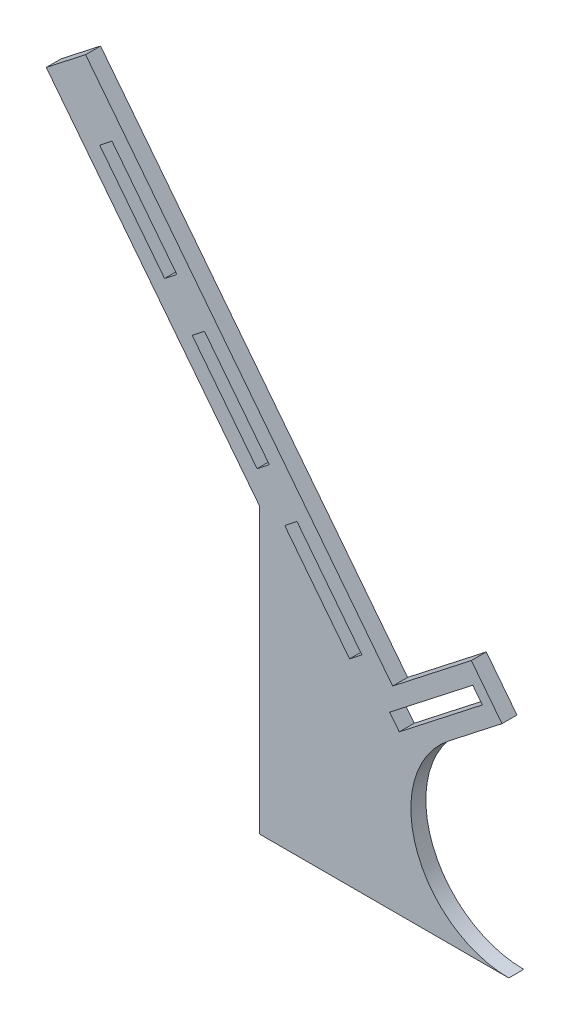
ISO-10303-21;
HEADER;
FILE_DESCRIPTION(('STEP AP214'),'2;1');
FILE_NAME('part.step','',(''),(''),'','','');
FILE_SCHEMA(('AUTOMOTIVE_DESIGN { 1 0 10303 214 1 1 1 1 }'));
ENDSEC;
DATA;
#1=APPLICATION_CONTEXT('core data for automotive mechanical design processes');
#2=APPLICATION_PROTOCOL_DEFINITION('international standard','automotive_design',2000,#1);
#3=PRODUCT_CONTEXT('',#1,'mechanical');
#4=PRODUCT('Part','Part','',(#3));
#5=PRODUCT_RELATED_PRODUCT_CATEGORY('part','',(#4));
#6=PRODUCT_DEFINITION_FORMATION('','',#4);
#7=PRODUCT_DEFINITION_CONTEXT('part definition',#1,'design');
#8=PRODUCT_DEFINITION('design','',#6,#7);
#9=PRODUCT_DEFINITION_SHAPE('','',#8);
#10=(LENGTH_UNIT() NAMED_UNIT(*) SI_UNIT(.MILLI.,.METRE.));
#11=(NAMED_UNIT(*) PLANE_ANGLE_UNIT() SI_UNIT($,.RADIAN.));
#12=(NAMED_UNIT(*) SI_UNIT($,.STERADIAN.) SOLID_ANGLE_UNIT());
#13=UNCERTAINTY_MEASURE_WITH_UNIT(LENGTH_MEASURE(1.E-05),#10,'distance_accuracy_value','');
#14=(GEOMETRIC_REPRESENTATION_CONTEXT(3) GLOBAL_UNCERTAINTY_ASSIGNED_CONTEXT((#13)) GLOBAL_UNIT_ASSIGNED_CONTEXT((#10,
#11,#12)) REPRESENTATION_CONTEXT('',''));
#15=CARTESIAN_POINT('',(0.,0.,0.));
#16=DIRECTION('',(0.,0.,1.));
#17=DIRECTION('',(1.,0.,0.));
#18=AXIS2_PLACEMENT_3D('',#15,#16,#17);
#19=CARTESIAN_POINT('',(1.72726328877394,39.0362588153415,3.));
#20=DIRECTION('',(-0.61544977632838,0.788176105205776,0.));
#21=DIRECTION('',(-0.788176105205776,-0.61544977632838,0.));
#22=AXIS2_PLACEMENT_3D('',#19,#20,#21);
#23=PLANE('',#22);
#24=DIRECTION('',(0.788176105205776,0.61544977632838,0.));
#25=VECTOR('',#24,1.);
#26=CARTESIAN_POINT('',(1.72726328877394,39.0362588153415,0.));
#27=LINE('',#26,#25);
#28=CARTESIAN_POINT('',(1.72726328877394,39.0362588153415,0.));
#29=VERTEX_POINT('',#28);
#30=CARTESIAN_POINT('',(17.4907853928895,51.3452543419092,0.));
#31=VERTEX_POINT('',#30);
#32=EDGE_CURVE('E326',#29,#31,#27,.T.);
#33=ORIENTED_EDGE('',*,*,#32,.F.);
#34=DIRECTION('',(0.,0.,-1.));
#35=VECTOR('',#34,1.);
#36=CARTESIAN_POINT('',(1.72726328877394,39.0362588153415,3.));
#37=LINE('',#36,#35);
#38=CARTESIAN_POINT('',(1.72726328877394,39.0362588153415,3.));
#39=VERTEX_POINT('',#38);
#40=EDGE_CURVE('E11',#39,#29,#37,.T.);
#41=ORIENTED_EDGE('',*,*,#40,.F.);
#42=DIRECTION('',(0.788176105205776,0.61544977632838,0.));
#43=VECTOR('',#42,1.);
#44=CARTESIAN_POINT('',(1.72726328877394,39.0362588153415,3.));
#45=LINE('',#44,#43);
#46=CARTESIAN_POINT('',(17.4907853928895,51.3452543419092,3.));
#47=VERTEX_POINT('',#46);
#48=EDGE_CURVE('E362',#39,#47,#45,.T.);
#49=ORIENTED_EDGE('',*,*,#48,.T.);
#50=DIRECTION('',(0.,0.,-1.));
#51=VECTOR('',#50,1.);
#52=CARTESIAN_POINT('',(17.4907853928895,51.3452543419092,3.));
#53=LINE('',#52,#51);
#54=EDGE_CURVE('E44',#47,#31,#53,.T.);
#55=ORIENTED_EDGE('',*,*,#54,.T.);
#56=EDGE_LOOP('',(#33,#41,#49,#55));
#57=FACE_BOUND('',#56,.T.);
#58=ADVANCED_FACE('F41',(#57),#23,.T.);
#59=CARTESIAN_POINT('',(1.72726328877394,39.0362588153415,3.));
#60=DIRECTION('',(-0.788176105205774,-0.615449776328383,0.));
#61=DIRECTION('',(0.615449776328383,-0.788176105205774,0.));
#62=AXIS2_PLACEMENT_3D('',#59,#60,#61);
#63=PLANE('',#62);
#64=DIRECTION('',(-0.615449776328382,0.788176105205774,0.));
#65=VECTOR('',#64,1.);
#66=CARTESIAN_POINT('',(1.72726328877394,39.0362588153415,0.));
#67=LINE('',#66,#65);
#68=CARTESIAN_POINT('',(-59.8177143440644,117.853869335919,0.));
#69=VERTEX_POINT('',#68);
#70=EDGE_CURVE('E366',#29,#69,#67,.T.);
#71=ORIENTED_EDGE('',*,*,#70,.T.);
#72=DIRECTION('',(0.,0.,-1.));
#73=VECTOR('',#72,1.);
#74=CARTESIAN_POINT('',(-59.8177143440644,117.853869335919,3.));
#75=LINE('',#74,#73);
#76=CARTESIAN_POINT('',(-59.8177143440644,117.853869335919,3.));
#77=VERTEX_POINT('',#76);
#78=EDGE_CURVE('E49',#77,#69,#75,.T.);
#79=ORIENTED_EDGE('',*,*,#78,.F.);
#80=DIRECTION('',(-0.615449776328382,0.788176105205774,0.));
#81=VECTOR('',#80,1.);
#82=CARTESIAN_POINT('',(1.72726328877394,39.0362588153415,3.));
#83=LINE('',#82,#81);
#84=EDGE_CURVE('E376',#39,#77,#83,.T.);
#85=ORIENTED_EDGE('',*,*,#84,.F.);
#86=ORIENTED_EDGE('',*,*,#40,.T.);
#87=EDGE_LOOP('',(#71,#79,#85,#86));
#88=FACE_BOUND('',#87,.T.);
#89=ADVANCED_FACE('F412',(#88),#63,.F.);
#90=CARTESIAN_POINT('',(-67.6994753961221,111.699371572635,3.));
#91=DIRECTION('',(-0.615449776328385,0.788176105205772,0.));
#92=DIRECTION('',(-0.788176105205772,-0.615449776328386,0.));
#93=AXIS2_PLACEMENT_3D('',#90,#91,#92);
#94=PLANE('',#93);
#95=DIRECTION('',(0.788176105205772,0.615449776328386,0.));
#96=VECTOR('',#95,1.);
#97=CARTESIAN_POINT('',(-67.6994753961221,111.699371572635,0.));
#98=LINE('',#97,#96);
#99=CARTESIAN_POINT('',(-67.6994753961221,111.699371572635,0.));
#100=VERTEX_POINT('',#99);
#101=EDGE_CURVE('E387',#100,#69,#98,.T.);
#102=ORIENTED_EDGE('',*,*,#101,.F.);
#103=DIRECTION('',(0.,0.,-1.));
#104=VECTOR('',#103,1.);
#105=CARTESIAN_POINT('',(-67.6994753961221,111.699371572635,3.));
#106=LINE('',#105,#104);
#107=CARTESIAN_POINT('',(-67.6994753961221,111.699371572635,3.));
#108=VERTEX_POINT('',#107);
#109=EDGE_CURVE('E393',#108,#100,#106,.T.);
#110=ORIENTED_EDGE('',*,*,#109,.F.);
#111=DIRECTION('',(0.788176105205772,0.615449776328386,0.));
#112=VECTOR('',#111,1.);
#113=CARTESIAN_POINT('',(-67.6994753961221,111.699371572635,3.));
#114=LINE('',#113,#112);
#115=EDGE_CURVE('E373',#108,#77,#114,.T.);
#116=ORIENTED_EDGE('',*,*,#115,.T.);
#117=ORIENTED_EDGE('',*,*,#78,.T.);
#118=EDGE_LOOP('',(#102,#110,#116,#117));
#119=FACE_BOUND('',#118,.T.);
#120=ADVANCED_FACE('F432',(#119),#94,.T.);
#121=CARTESIAN_POINT('',(0.,25.,3.));
#122=DIRECTION('',(-0.788176105205774,-0.615449776328383,0.));
#123=DIRECTION('',(0.615449776328383,-0.788176105205774,0.));
#124=AXIS2_PLACEMENT_3D('',#121,#122,#123);
#125=PLANE('',#124);
#126=DIRECTION('',(0.,0.,-1.));
#127=VECTOR('',#126,1.);
#128=CARTESIAN_POINT('',(-25.,57.0162641827508,3.));
#129=LINE('',#128,#127);
#130=CARTESIAN_POINT('',(-25.,57.0162641827508,3.));
#131=VERTEX_POINT('',#130);
#132=CARTESIAN_POINT('',(-25.,57.0162641827507,0.));
#133=VERTEX_POINT('',#132);
#134=EDGE_CURVE('E235',#131,#133,#129,.T.);
#135=ORIENTED_EDGE('',*,*,#134,.F.);
#136=DIRECTION('',(-0.615449776328383,0.788176105205774,0.));
#137=VECTOR('',#136,1.);
#138=CARTESIAN_POINT('',(0.,25.,3.));
#139=LINE('',#138,#137);
#140=EDGE_CURVE('E371',#131,#108,#139,.T.);
#141=ORIENTED_EDGE('',*,*,#140,.T.);
#142=ORIENTED_EDGE('',*,*,#109,.T.);
#143=DIRECTION('',(-0.615449776328383,0.788176105205774,0.));
#144=VECTOR('',#143,1.);
#145=CARTESIAN_POINT('',(0.,25.,0.));
#146=LINE('',#145,#144);
#147=EDGE_CURVE('E385',#133,#100,#146,.T.);
#148=ORIENTED_EDGE('',*,*,#147,.F.);
#149=EDGE_LOOP('',(#135,#141,#142,#148));
#150=FACE_BOUND('',#149,.T.);
#151=ADVANCED_FACE('F429',(#150),#125,.T.);
#152=CARTESIAN_POINT('',(0.,25.,3.));
#153=DIRECTION('',(-0.61544977632838,0.788176105205776,0.));
#154=DIRECTION('',(-0.788176105205777,-0.61544977632838,0.));
#155=AXIS2_PLACEMENT_3D('',#152,#153,#154);
#156=PLANE('',#155);
#157=DIRECTION('',(0.788176105205776,0.61544977632838,0.));
#158=VECTOR('',#157,1.);
#159=CARTESIAN_POINT('',(0.,25.,3.));
#160=LINE('',#159,#158);
#161=CARTESIAN_POINT('',(12.9225928541933,35.0906470383539,3.));
#162=VERTEX_POINT('',#161);
#163=CARTESIAN_POINT('',(23.6452831561733,43.4634932898514,3.));
#164=VERTEX_POINT('',#163);
#165=EDGE_CURVE('E369',#162,#164,#160,.T.);
#166=ORIENTED_EDGE('',*,*,#165,.F.);
#167=DIRECTION('',(0.,0.,-1.));
#168=VECTOR('',#167,1.);
#169=CARTESIAN_POINT('',(12.9225928541933,35.0906470383539,3.));
#170=LINE('',#169,#168);
#171=CARTESIAN_POINT('',(12.9225928541933,35.0906470383539,0.));
#172=VERTEX_POINT('',#171);
#173=EDGE_CURVE('E216',#162,#172,#170,.T.);
#174=ORIENTED_EDGE('',*,*,#173,.T.);
#175=DIRECTION('',(0.788176105205776,0.61544977632838,0.));
#176=VECTOR('',#175,1.);
#177=CARTESIAN_POINT('',(0.,25.,0.));
#178=LINE('',#177,#176);
#179=CARTESIAN_POINT('',(23.6452831561733,43.4634932898514,0.));
#180=VERTEX_POINT('',#179);
#181=EDGE_CURVE('E383',#172,#180,#178,.T.);
#182=ORIENTED_EDGE('',*,*,#181,.T.);
#183=DIRECTION('',(0.,0.,-1.));
#184=VECTOR('',#183,1.);
#185=CARTESIAN_POINT('',(23.6452831561733,43.4634932898514,3.));
#186=LINE('',#185,#184);
#187=EDGE_CURVE('E395',#164,#180,#186,.T.);
#188=ORIENTED_EDGE('',*,*,#187,.F.);
#189=EDGE_LOOP('',(#166,#174,#182,#188));
#190=FACE_BOUND('',#189,.T.);
#191=ADVANCED_FACE('F416',(#190),#156,.F.);
#192=CARTESIAN_POINT('',(17.4907853928895,51.3452543419092,3.));
#193=DIRECTION('',(0.788176105205776,0.61544977632838,0.));
#194=DIRECTION('',(-0.61544977632838,0.788176105205776,0.));
#195=AXIS2_PLACEMENT_3D('',#192,#193,#194);
#196=PLANE('',#195);
#197=DIRECTION('',(0.61544977632838,-0.788176105205776,0.));
#198=VECTOR('',#197,1.);
#199=CARTESIAN_POINT('',(17.4907853928895,51.3452543419092,0.));
#200=LINE('',#199,#198);
#201=EDGE_CURVE('E380',#31,#180,#200,.T.);
#202=ORIENTED_EDGE('',*,*,#201,.F.);
#203=ORIENTED_EDGE('',*,*,#54,.F.);
#204=DIRECTION('',(0.61544977632838,-0.788176105205776,0.));
#205=VECTOR('',#204,1.);
#206=CARTESIAN_POINT('',(17.4907853928895,51.3452543419092,3.));
#207=LINE('',#206,#205);
#208=EDGE_CURVE('E365',#47,#164,#207,.T.);
#209=ORIENTED_EDGE('',*,*,#208,.T.);
#210=ORIENTED_EDGE('',*,*,#187,.T.);
#211=EDGE_LOOP('',(#202,#203,#209,#210));
#212=FACE_BOUND('',#211,.T.);
#213=ADVANCED_FACE('F404',(#212),#196,.T.);
#214=CARTESIAN_POINT('',(0.,0.,3.));
#215=DIRECTION('',(0.,0.,-1.));
#216=DIRECTION('',(-1.,0.,0.));
#217=AXIS2_PLACEMENT_3D('',#214,#215,#216);
#218=PLANE('',#217);
#219=CARTESIAN_POINT('',(25.,19.6237087254422,3.));
#220=DIRECTION('',(0.,0.,1.));
#221=DIRECTION('',(1.,0.,0.));
#222=AXIS2_PLACEMENT_3D('',#219,#220,#221);
#223=CIRCLE('',#222,19.6237087254422);
#224=CARTESIAN_POINT('',(25.,0.,3.));
#225=VERTEX_POINT('',#224);
#226=EDGE_CURVE('E209',#225,#162,#223,.F.);
#227=ORIENTED_EDGE('',*,*,#226,.T.);
#228=ORIENTED_EDGE('',*,*,#165,.T.);
#229=ORIENTED_EDGE('',*,*,#208,.F.);
#230=ORIENTED_EDGE('',*,*,#48,.F.);
#231=ORIENTED_EDGE('',*,*,#84,.T.);
#232=ORIENTED_EDGE('',*,*,#115,.F.);
#233=ORIENTED_EDGE('',*,*,#140,.F.);
#234=DIRECTION('',(0.,1.,0.));
#235=VECTOR('',#234,1.);
#236=CARTESIAN_POINT('',(-25.,0.,3.));
#237=LINE('',#236,#235);
#238=CARTESIAN_POINT('',(-25.,0.,3.));
#239=VERTEX_POINT('',#238);
#240=EDGE_CURVE('E219',#239,#131,#237,.T.);
#241=ORIENTED_EDGE('',*,*,#240,.F.);
#242=DIRECTION('',(1.,0.,0.));
#243=VECTOR('',#242,1.);
#244=CARTESIAN_POINT('',(0.,0.,3.));
#245=LINE('',#244,#243);
#246=EDGE_CURVE('E220',#239,#225,#245,.T.);
#247=ORIENTED_EDGE('',*,*,#246,.T.);
#248=EDGE_LOOP('',(#227,#228,#229,#230,#231,#232,#233,#241,#247));
#249=FACE_BOUND('',#248,.T.);
#250=DIRECTION('',(-0.788176105205774,-0.615449776328383,0.));
#251=VECTOR('',#250,1.);
#252=CARTESIAN_POINT('',(-53.2865048829201,68.2413927082801,3.));
#253=LINE('',#252,#251);
#254=CARTESIAN_POINT('',(-35.9878171772055,81.7491270952253,3.));
#255=VERTEX_POINT('',#254);
#256=CARTESIAN_POINT('',(-38.4492911537631,79.8270774437517,3.));
#257=VERTEX_POINT('',#256);
#258=EDGE_CURVE('E254',#255,#257,#253,.T.);
#259=ORIENTED_EDGE('',*,*,#258,.F.);
#260=DIRECTION('',(-0.615449776328384,0.788176105205774,0.));
#261=VECTOR('',#260,1.);
#262=CARTESIAN_POINT('',(35.8378813180544,-10.2344944301683,3.));
#263=LINE('',#262,#261);
#264=CARTESIAN_POINT('',(-22.9876715518211,65.1004832249638,3.));
#265=VERTEX_POINT('',#264);
#266=EDGE_CURVE('E65',#265,#255,#263,.T.);
#267=ORIENTED_EDGE('',*,*,#266,.F.);
#268=DIRECTION('',(0.788176105205774,0.615449776328383,0.));
#269=VECTOR('',#268,1.);
#270=CARTESIAN_POINT('',(-40.2863592575356,51.5927488380186,3.));
#271=LINE('',#270,#269);
#272=CARTESIAN_POINT('',(-25.4491455283787,63.1784335734902,3.));
#273=VERTEX_POINT('',#272);
#274=EDGE_CURVE('E243',#273,#265,#271,.T.);
#275=ORIENTED_EDGE('',*,*,#274,.F.);
#276=DIRECTION('',(0.615449776328384,-0.788176105205774,0.));
#277=VECTOR('',#276,1.);
#278=CARTESIAN_POINT('',(33.3764073414968,-12.1565440816418,3.));
#279=LINE('',#278,#277);
#280=EDGE_CURVE('E258',#257,#273,#279,.T.);
#281=ORIENTED_EDGE('',*,*,#280,.F.);
#282=EDGE_LOOP('',(#259,#267,#275,#281));
#283=FACE_BOUND('',#282,.T.);
#284=DIRECTION('',(-0.788176105205774,-0.615449776328383,0.));
#285=VECTOR('',#284,1.);
#286=CARTESIAN_POINT('',(-34.7473112705801,44.4991638911666,3.));
#287=LINE('',#286,#285);
#288=CARTESIAN_POINT('',(-17.4486235648656,58.0068982781118,3.));
#289=VERTEX_POINT('',#288);
#290=CARTESIAN_POINT('',(-19.9100975414232,56.0848486266382,3.));
#291=VERTEX_POINT('',#290);
#292=EDGE_CURVE('E233',#289,#291,#287,.T.);
#293=ORIENTED_EDGE('',*,*,#292,.F.);
#294=DIRECTION('',(-0.615449776328384,0.788176105205774,0.));
#295=VECTOR('',#294,1.);
#296=CARTESIAN_POINT('',(54.3770749303944,-33.9767232472818,3.));
#297=LINE('',#296,#295);
#298=CARTESIAN_POINT('',(-4.44847793948119,41.3582544078502,3.));
#299=VERTEX_POINT('',#298);
#300=EDGE_CURVE('E231',#299,#289,#297,.T.);
#301=ORIENTED_EDGE('',*,*,#300,.F.);
#302=DIRECTION('',(0.788176105205774,0.615449776328383,0.));
#303=VECTOR('',#302,1.);
#304=CARTESIAN_POINT('',(-21.7471656451957,27.850520020905,3.));
#305=LINE('',#304,#303);
#306=CARTESIAN_POINT('',(-6.90995191603881,39.4362047563767,3.));
#307=VERTEX_POINT('',#306);
#308=EDGE_CURVE('E275',#307,#299,#305,.T.);
#309=ORIENTED_EDGE('',*,*,#308,.F.);
#310=DIRECTION('',(0.615449776328384,-0.788176105205774,0.));
#311=VECTOR('',#310,1.);
#312=CARTESIAN_POINT('',(51.9156009538367,-35.8987728987554,3.));
#313=LINE('',#312,#311);
#314=EDGE_CURVE('E287',#291,#307,#313,.T.);
#315=ORIENTED_EDGE('',*,*,#314,.F.);
#316=EDGE_LOOP('',(#293,#301,#309,#315));
#317=FACE_BOUND('',#316,.T.);
#318=DIRECTION('',(-0.788176105205774,-0.615449776328383,0.));
#319=VECTOR('',#318,1.);
#320=CARTESIAN_POINT('',(-71.82569849526,91.9836215253936,3.));
#321=LINE('',#320,#319);
#322=CARTESIAN_POINT('',(-54.5270107895454,105.491355912339,3.));
#323=VERTEX_POINT('',#322);
#324=CARTESIAN_POINT('',(-56.988484766103,103.569306260865,3.));
#325=VERTEX_POINT('',#324);
#326=EDGE_CURVE('E315',#323,#325,#321,.T.);
#327=ORIENTED_EDGE('',*,*,#326,.F.);
#328=DIRECTION('',(-0.615449776328384,0.788176105205774,0.));
#329=VECTOR('',#328,1.);
#330=CARTESIAN_POINT('',(17.2986877057145,13.5077343869452,3.));
#331=LINE('',#330,#329);
#332=CARTESIAN_POINT('',(-41.526865164161,88.8427120420773,3.));
#333=VERTEX_POINT('',#332);
#334=EDGE_CURVE('E313',#333,#323,#331,.T.);
#335=ORIENTED_EDGE('',*,*,#334,.F.);
#336=DIRECTION('',(0.788176105205774,0.615449776328383,0.));
#337=VECTOR('',#336,1.);
#338=CARTESIAN_POINT('',(-58.8255528698755,75.3349776551321,3.));
#339=LINE('',#338,#337);
#340=CARTESIAN_POINT('',(-43.9883391407186,86.9206623906037,3.));
#341=VERTEX_POINT('',#340);
#342=EDGE_CURVE('E303',#341,#333,#339,.T.);
#343=ORIENTED_EDGE('',*,*,#342,.F.);
#344=DIRECTION('',(0.615449776328384,-0.788176105205774,0.));
#345=VECTOR('',#344,1.);
#346=CARTESIAN_POINT('',(14.8372137291569,11.5856847354717,3.));
#347=LINE('',#346,#345);
#348=EDGE_CURVE('E319',#325,#341,#347,.T.);
#349=ORIENTED_EDGE('',*,*,#348,.F.);
#350=EDGE_LOOP('',(#327,#335,#343,#349));
#351=FACE_BOUND('',#350,.T.);
#352=DIRECTION('',(0.788176105205776,0.61544977632838,0.));
#353=VECTOR('',#352,1.);
#354=CARTESIAN_POINT('',(1.13216154277104,34.2089680470221,3.));
#355=LINE('',#354,#353);
#356=CARTESIAN_POINT('',(1.13216154277104,34.2089680470221,3.));
#357=VERTEX_POINT('',#356);
#358=CARTESIAN_POINT('',(17.7808054130326,47.2091136724065,3.));
#359=VERTEX_POINT('',#358);
#360=EDGE_CURVE('E349',#357,#359,#355,.T.);
#361=ORIENTED_EDGE('',*,*,#360,.T.);
#362=DIRECTION('',(-0.61544977632838,0.788176105205776,0.));
#363=VECTOR('',#362,1.);
#364=CARTESIAN_POINT('',(19.7028550645062,44.7476396958489,3.));
#365=LINE('',#364,#363);
#366=CARTESIAN_POINT('',(19.7028550645062,44.7476396958489,3.));
#367=VERTEX_POINT('',#366);
#368=EDGE_CURVE('E316',#367,#359,#365,.T.);
#369=ORIENTED_EDGE('',*,*,#368,.F.);
#370=DIRECTION('',(0.788176105205776,0.615449776328381,0.));
#371=VECTOR('',#370,1.);
#372=CARTESIAN_POINT('',(3.05421119424456,31.7474940704645,3.));
#373=LINE('',#372,#371);
#374=CARTESIAN_POINT('',(3.05421119424456,31.7474940704645,3.));
#375=VERTEX_POINT('',#374);
#376=EDGE_CURVE('E342',#375,#367,#373,.T.);
#377=ORIENTED_EDGE('',*,*,#376,.F.);
#378=DIRECTION('',(-0.61544977632838,0.788176105205776,0.));
#379=VECTOR('',#378,1.);
#380=CARTESIAN_POINT('',(3.05421119424456,31.7474940704645,3.));
#381=LINE('',#380,#379);
#382=EDGE_CURVE('E345',#375,#357,#381,.T.);
#383=ORIENTED_EDGE('',*,*,#382,.T.);
#384=EDGE_LOOP('',(#361,#369,#377,#383));
#385=FACE_BOUND('',#384,.T.);
#386=ADVANCED_FACE('F224',(#249,#283,#317,#351,#385),#218,.F.);
#387=CARTESIAN_POINT('',(0.,0.,0.));
#388=DIRECTION('',(0.,0.,-1.));
#389=DIRECTION('',(-1.,0.,0.));
#390=AXIS2_PLACEMENT_3D('',#387,#388,#389);
#391=PLANE('',#390);
#392=ORIENTED_EDGE('',*,*,#181,.F.);
#393=CARTESIAN_POINT('',(25.,19.6237087254422,0.));
#394=DIRECTION('',(0.,0.,1.));
#395=DIRECTION('',(1.,0.,0.));
#396=AXIS2_PLACEMENT_3D('',#393,#394,#395);
#397=CIRCLE('',#396,19.6237087254422);
#398=CARTESIAN_POINT('',(25.,0.,0.));
#399=VERTEX_POINT('',#398);
#400=EDGE_CURVE('E417',#399,#172,#397,.F.);
#401=ORIENTED_EDGE('',*,*,#400,.F.);
#402=DIRECTION('',(1.,0.,0.));
#403=VECTOR('',#402,1.);
#404=CARTESIAN_POINT('',(0.,0.,0.));
#405=LINE('',#404,#403);
#406=CARTESIAN_POINT('',(-25.,0.,0.));
#407=VERTEX_POINT('',#406);
#408=EDGE_CURVE('E230',#407,#399,#405,.T.);
#409=ORIENTED_EDGE('',*,*,#408,.F.);
#410=DIRECTION('',(0.,1.,0.));
#411=VECTOR('',#410,1.);
#412=CARTESIAN_POINT('',(-25.,0.,0.));
#413=LINE('',#412,#411);
#414=EDGE_CURVE('E57',#407,#133,#413,.T.);
#415=ORIENTED_EDGE('',*,*,#414,.T.);
#416=ORIENTED_EDGE('',*,*,#147,.T.);
#417=ORIENTED_EDGE('',*,*,#101,.T.);
#418=ORIENTED_EDGE('',*,*,#70,.F.);
#419=ORIENTED_EDGE('',*,*,#32,.T.);
#420=ORIENTED_EDGE('',*,*,#201,.T.);
#421=EDGE_LOOP('',(#392,#401,#409,#415,#416,#417,#418,#419,#420));
#422=FACE_BOUND('',#421,.T.);
#423=DIRECTION('',(-0.615449776328384,0.788176105205774,0.));
#424=VECTOR('',#423,1.);
#425=CARTESIAN_POINT('',(35.8378813180544,-10.2344944301683,0.));
#426=LINE('',#425,#424);
#427=CARTESIAN_POINT('',(-22.9876715518211,65.1004832249638,0.));
#428=VERTEX_POINT('',#427);
#429=CARTESIAN_POINT('',(-35.9878171772055,81.7491270952253,0.));
#430=VERTEX_POINT('',#429);
#431=EDGE_CURVE('E239',#428,#430,#426,.T.);
#432=ORIENTED_EDGE('',*,*,#431,.T.);
#433=DIRECTION('',(-0.788176105205774,-0.615449776328383,0.));
#434=VECTOR('',#433,1.);
#435=CARTESIAN_POINT('',(-53.2865048829201,68.2413927082801,0.));
#436=LINE('',#435,#434);
#437=CARTESIAN_POINT('',(-38.4492911537631,79.8270774437518,0.));
#438=VERTEX_POINT('',#437);
#439=EDGE_CURVE('E242',#430,#438,#436,.T.);
#440=ORIENTED_EDGE('',*,*,#439,.T.);
#441=DIRECTION('',(0.615449776328384,-0.788176105205774,0.));
#442=VECTOR('',#441,1.);
#443=CARTESIAN_POINT('',(33.3764073414968,-12.1565440816418,0.));
#444=LINE('',#443,#442);
#445=CARTESIAN_POINT('',(-25.4491455283787,63.1784335734902,0.));
#446=VERTEX_POINT('',#445);
#447=EDGE_CURVE('E246',#438,#446,#444,.T.);
#448=ORIENTED_EDGE('',*,*,#447,.T.);
#449=DIRECTION('',(0.788176105205774,0.615449776328383,0.));
#450=VECTOR('',#449,1.);
#451=CARTESIAN_POINT('',(-40.2863592575356,51.5927488380186,0.));
#452=LINE('',#451,#450);
#453=EDGE_CURVE('E249',#446,#428,#452,.T.);
#454=ORIENTED_EDGE('',*,*,#453,.T.);
#455=EDGE_LOOP('',(#432,#440,#448,#454));
#456=FACE_BOUND('',#455,.T.);
#457=DIRECTION('',(-0.615449776328384,0.788176105205774,0.));
#458=VECTOR('',#457,1.);
#459=CARTESIAN_POINT('',(54.3770749303944,-33.9767232472818,0.));
#460=LINE('',#459,#458);
#461=CARTESIAN_POINT('',(-4.44847793948119,41.3582544078502,0.));
#462=VERTEX_POINT('',#461);
#463=CARTESIAN_POINT('',(-17.4486235648656,58.0068982781118,0.));
#464=VERTEX_POINT('',#463);
#465=EDGE_CURVE('E271',#462,#464,#460,.T.);
#466=ORIENTED_EDGE('',*,*,#465,.T.);
#467=DIRECTION('',(-0.788176105205774,-0.615449776328383,0.));
#468=VECTOR('',#467,1.);
#469=CARTESIAN_POINT('',(-34.7473112705801,44.4991638911666,0.));
#470=LINE('',#469,#468);
#471=CARTESIAN_POINT('',(-19.9100975414232,56.0848486266382,0.));
#472=VERTEX_POINT('',#471);
#473=EDGE_CURVE('E274',#464,#472,#470,.T.);
#474=ORIENTED_EDGE('',*,*,#473,.T.);
#475=DIRECTION('',(0.615449776328384,-0.788176105205774,0.));
#476=VECTOR('',#475,1.);
#477=CARTESIAN_POINT('',(51.9156009538367,-35.8987728987554,0.));
#478=LINE('',#477,#476);
#479=CARTESIAN_POINT('',(-6.90995191603881,39.4362047563767,0.));
#480=VERTEX_POINT('',#479);
#481=EDGE_CURVE('E278',#472,#480,#478,.T.);
#482=ORIENTED_EDGE('',*,*,#481,.T.);
#483=DIRECTION('',(0.788176105205774,0.615449776328383,0.));
#484=VECTOR('',#483,1.);
#485=CARTESIAN_POINT('',(-21.7471656451957,27.850520020905,0.));
#486=LINE('',#485,#484);
#487=EDGE_CURVE('E281',#480,#462,#486,.T.);
#488=ORIENTED_EDGE('',*,*,#487,.T.);
#489=EDGE_LOOP('',(#466,#474,#482,#488));
#490=FACE_BOUND('',#489,.T.);
#491=DIRECTION('',(-0.615449776328384,0.788176105205774,0.));
#492=VECTOR('',#491,1.);
#493=CARTESIAN_POINT('',(17.2986877057145,13.5077343869452,0.));
#494=LINE('',#493,#492);
#495=CARTESIAN_POINT('',(-41.526865164161,88.8427120420773,0.));
#496=VERTEX_POINT('',#495);
#497=CARTESIAN_POINT('',(-54.5270107895454,105.491355912339,0.));
#498=VERTEX_POINT('',#497);
#499=EDGE_CURVE('E299',#496,#498,#494,.T.);
#500=ORIENTED_EDGE('',*,*,#499,.T.);
#501=DIRECTION('',(-0.788176105205774,-0.615449776328383,0.));
#502=VECTOR('',#501,1.);
#503=CARTESIAN_POINT('',(-71.82569849526,91.9836215253936,0.));
#504=LINE('',#503,#502);
#505=CARTESIAN_POINT('',(-56.988484766103,103.569306260865,0.));
#506=VERTEX_POINT('',#505);
#507=EDGE_CURVE('E302',#498,#506,#504,.T.);
#508=ORIENTED_EDGE('',*,*,#507,.T.);
#509=DIRECTION('',(0.615449776328384,-0.788176105205774,0.));
#510=VECTOR('',#509,1.);
#511=CARTESIAN_POINT('',(14.8372137291569,11.5856847354717,0.));
#512=LINE('',#511,#510);
#513=CARTESIAN_POINT('',(-43.9883391407186,86.9206623906037,0.));
#514=VERTEX_POINT('',#513);
#515=EDGE_CURVE('E306',#506,#514,#512,.T.);
#516=ORIENTED_EDGE('',*,*,#515,.T.);
#517=DIRECTION('',(0.788176105205774,0.615449776328383,0.));
#518=VECTOR('',#517,1.);
#519=CARTESIAN_POINT('',(-58.8255528698755,75.3349776551321,0.));
#520=LINE('',#519,#518);
#521=EDGE_CURVE('E309',#514,#496,#520,.T.);
#522=ORIENTED_EDGE('',*,*,#521,.T.);
#523=EDGE_LOOP('',(#500,#508,#516,#522));
#524=FACE_BOUND('',#523,.T.);
#525=DIRECTION('',(-0.61544977632838,0.788176105205776,0.));
#526=VECTOR('',#525,1.);
#527=CARTESIAN_POINT('',(19.7028550645062,44.7476396958489,0.));
#528=LINE('',#527,#526);
#529=CARTESIAN_POINT('',(19.7028550645062,44.7476396958489,0.));
#530=VERTEX_POINT('',#529);
#531=CARTESIAN_POINT('',(17.7808054130326,47.2091136724065,0.));
#532=VERTEX_POINT('',#531);
#533=EDGE_CURVE('E346',#530,#532,#528,.T.);
#534=ORIENTED_EDGE('',*,*,#533,.T.);
#535=DIRECTION('',(0.788176105205776,0.61544977632838,0.));
#536=VECTOR('',#535,1.);
#537=CARTESIAN_POINT('',(1.13216154277104,34.2089680470221,0.));
#538=LINE('',#537,#536);
#539=CARTESIAN_POINT('',(1.13216154277104,34.2089680470221,0.));
#540=VERTEX_POINT('',#539);
#541=EDGE_CURVE('E358',#540,#532,#538,.T.);
#542=ORIENTED_EDGE('',*,*,#541,.F.);
#543=DIRECTION('',(-0.61544977632838,0.788176105205776,0.));
#544=VECTOR('',#543,1.);
#545=CARTESIAN_POINT('',(3.05421119424456,31.7474940704645,0.));
#546=LINE('',#545,#544);
#547=CARTESIAN_POINT('',(3.05421119424456,31.7474940704645,0.));
#548=VERTEX_POINT('',#547);
#549=EDGE_CURVE('E355',#548,#540,#546,.T.);
#550=ORIENTED_EDGE('',*,*,#549,.F.);
#551=DIRECTION('',(0.788176105205776,0.615449776328381,0.));
#552=VECTOR('',#551,1.);
#553=CARTESIAN_POINT('',(3.05421119424456,31.7474940704645,0.));
#554=LINE('',#553,#552);
#555=EDGE_CURVE('E336',#548,#530,#554,.T.);
#556=ORIENTED_EDGE('',*,*,#555,.T.);
#557=EDGE_LOOP('',(#534,#542,#550,#556));
#558=FACE_BOUND('',#557,.T.);
#559=ADVANCED_FACE('F407',(#422,#456,#490,#524,#558),#391,.T.);
#560=CARTESIAN_POINT('',(19.7028550645062,44.7476396958489,0.));
#561=DIRECTION('',(0.788176105205776,0.61544977632838,0.));
#562=DIRECTION('',(-0.61544977632838,0.788176105205776,0.));
#563=AXIS2_PLACEMENT_3D('',#560,#561,#562);
#564=PLANE('',#563);
#565=ORIENTED_EDGE('',*,*,#368,.T.);
#566=DIRECTION('',(0.,0.,1.));
#567=VECTOR('',#566,1.);
#568=CARTESIAN_POINT('',(17.7808054130326,47.2091136724065,0.));
#569=LINE('',#568,#567);
#570=EDGE_CURVE('E333',#532,#359,#569,.T.);
#571=ORIENTED_EDGE('',*,*,#570,.F.);
#572=ORIENTED_EDGE('',*,*,#533,.F.);
#573=DIRECTION('',(0.,0.,1.));
#574=VECTOR('',#573,1.);
#575=CARTESIAN_POINT('',(19.7028550645062,44.7476396958489,0.));
#576=LINE('',#575,#574);
#577=EDGE_CURVE('E265',#530,#367,#576,.T.);
#578=ORIENTED_EDGE('',*,*,#577,.T.);
#579=EDGE_LOOP('',(#565,#571,#572,#578));
#580=FACE_BOUND('',#579,.T.);
#581=ADVANCED_FACE('F472',(#580),#564,.F.);
#582=CARTESIAN_POINT('',(3.05421119424456,31.7474940704645,0.));
#583=DIRECTION('',(0.615449776328381,-0.788176105205776,0.));
#584=DIRECTION('',(0.788176105205776,0.615449776328381,0.));
#585=AXIS2_PLACEMENT_3D('',#582,#583,#584);
#586=PLANE('',#585);
#587=ORIENTED_EDGE('',*,*,#376,.T.);
#588=ORIENTED_EDGE('',*,*,#577,.F.);
#589=ORIENTED_EDGE('',*,*,#555,.F.);
#590=DIRECTION('',(0.,0.,1.));
#591=VECTOR('',#590,1.);
#592=CARTESIAN_POINT('',(3.05421119424456,31.7474940704645,0.));
#593=LINE('',#592,#591);
#594=EDGE_CURVE('E339',#548,#375,#593,.T.);
#595=ORIENTED_EDGE('',*,*,#594,.T.);
#596=EDGE_LOOP('',(#587,#588,#589,#595));
#597=FACE_BOUND('',#596,.T.);
#598=ADVANCED_FACE('F477',(#597),#586,.F.);
#599=CARTESIAN_POINT('',(3.05421119424456,31.7474940704645,0.));
#600=DIRECTION('',(0.788176105205776,0.61544977632838,0.));
#601=DIRECTION('',(-0.61544977632838,0.788176105205776,0.));
#602=AXIS2_PLACEMENT_3D('',#599,#600,#601);
#603=PLANE('',#602);
#604=ORIENTED_EDGE('',*,*,#382,.F.);
#605=ORIENTED_EDGE('',*,*,#594,.F.);
#606=ORIENTED_EDGE('',*,*,#549,.T.);
#607=DIRECTION('',(0.,0.,1.));
#608=VECTOR('',#607,1.);
#609=CARTESIAN_POINT('',(1.13216154277104,34.2089680470221,0.));
#610=LINE('',#609,#608);
#611=EDGE_CURVE('E337',#540,#357,#610,.T.);
#612=ORIENTED_EDGE('',*,*,#611,.T.);
#613=EDGE_LOOP('',(#604,#605,#606,#612));
#614=FACE_BOUND('',#613,.T.);
#615=ADVANCED_FACE('F490',(#614),#603,.T.);
#616=CARTESIAN_POINT('',(1.13216154277104,34.2089680470221,0.));
#617=DIRECTION('',(0.61544977632838,-0.788176105205776,0.));
#618=DIRECTION('',(0.788176105205777,0.61544977632838,0.));
#619=AXIS2_PLACEMENT_3D('',#616,#617,#618);
#620=PLANE('',#619);
#621=ORIENTED_EDGE('',*,*,#360,.F.);
#622=ORIENTED_EDGE('',*,*,#611,.F.);
#623=ORIENTED_EDGE('',*,*,#541,.T.);
#624=ORIENTED_EDGE('',*,*,#570,.T.);
#625=EDGE_LOOP('',(#621,#622,#623,#624));
#626=FACE_BOUND('',#625,.T.);
#627=ADVANCED_FACE('F501',(#626),#620,.T.);
#628=CARTESIAN_POINT('',(17.2986877057145,13.5077343869452,0.));
#629=DIRECTION('',(0.788176105205773,0.615449776328384,0.));
#630=DIRECTION('',(-0.615449776328384,0.788176105205774,0.));
#631=AXIS2_PLACEMENT_3D('',#628,#629,#630);
#632=PLANE('',#631);
#633=ORIENTED_EDGE('',*,*,#334,.T.);
#634=DIRECTION('',(0.,0.,1.));
#635=VECTOR('',#634,1.);
#636=CARTESIAN_POINT('',(-54.5270107895454,105.491355912339,0.));
#637=LINE('',#636,#635);
#638=EDGE_CURVE('E312',#498,#323,#637,.T.);
#639=ORIENTED_EDGE('',*,*,#638,.F.);
#640=ORIENTED_EDGE('',*,*,#499,.F.);
#641=DIRECTION('',(0.,0.,1.));
#642=VECTOR('',#641,1.);
#643=CARTESIAN_POINT('',(-41.526865164161,88.8427120420773,0.));
#644=LINE('',#643,#642);
#645=EDGE_CURVE('E324',#496,#333,#644,.T.);
#646=ORIENTED_EDGE('',*,*,#645,.T.);
#647=EDGE_LOOP('',(#633,#639,#640,#646));
#648=FACE_BOUND('',#647,.T.);
#649=ADVANCED_FACE('F512',(#648),#632,.F.);
#650=CARTESIAN_POINT('',(-58.8255528698755,75.3349776551321,0.));
#651=DIRECTION('',(0.615449776328384,-0.788176105205774,0.));
#652=DIRECTION('',(0.788176105205774,0.615449776328384,0.));
#653=AXIS2_PLACEMENT_3D('',#650,#651,#652);
#654=PLANE('',#653);
#655=ORIENTED_EDGE('',*,*,#342,.T.);
#656=ORIENTED_EDGE('',*,*,#645,.F.);
#657=ORIENTED_EDGE('',*,*,#521,.F.);
#658=DIRECTION('',(0.,0.,1.));
#659=VECTOR('',#658,1.);
#660=CARTESIAN_POINT('',(-43.9883391407186,86.9206623906037,0.));
#661=LINE('',#660,#659);
#662=EDGE_CURVE('E327',#514,#341,#661,.T.);
#663=ORIENTED_EDGE('',*,*,#662,.T.);
#664=EDGE_LOOP('',(#655,#656,#657,#663));
#665=FACE_BOUND('',#664,.T.);
#666=ADVANCED_FACE('F523',(#665),#654,.F.);
#667=CARTESIAN_POINT('',(14.8372137291569,11.5856847354717,0.));
#668=DIRECTION('',(-0.788176105205773,-0.615449776328384,0.));
#669=DIRECTION('',(0.615449776328384,-0.788176105205774,0.));
#670=AXIS2_PLACEMENT_3D('',#667,#668,#669);
#671=PLANE('',#670);
#672=ORIENTED_EDGE('',*,*,#348,.T.);
#673=ORIENTED_EDGE('',*,*,#662,.F.);
#674=ORIENTED_EDGE('',*,*,#515,.F.);
#675=DIRECTION('',(0.,0.,1.));
#676=VECTOR('',#675,1.);
#677=CARTESIAN_POINT('',(-56.988484766103,103.569306260865,0.));
#678=LINE('',#677,#676);
#679=EDGE_CURVE('E329',#506,#325,#678,.T.);
#680=ORIENTED_EDGE('',*,*,#679,.T.);
#681=EDGE_LOOP('',(#672,#673,#674,#680));
#682=FACE_BOUND('',#681,.T.);
#683=ADVANCED_FACE('F534',(#682),#671,.F.);
#684=CARTESIAN_POINT('',(-71.82569849526,91.9836215253936,0.));
#685=DIRECTION('',(-0.615449776328384,0.788176105205774,0.));
#686=DIRECTION('',(-0.788176105205774,-0.615449776328384,0.));
#687=AXIS2_PLACEMENT_3D('',#684,#685,#686);
#688=PLANE('',#687);
#689=ORIENTED_EDGE('',*,*,#326,.T.);
#690=ORIENTED_EDGE('',*,*,#679,.F.);
#691=ORIENTED_EDGE('',*,*,#507,.F.);
#692=ORIENTED_EDGE('',*,*,#638,.T.);
#693=EDGE_LOOP('',(#689,#690,#691,#692));
#694=FACE_BOUND('',#693,.T.);
#695=ADVANCED_FACE('F545',(#694),#688,.F.);
#696=CARTESIAN_POINT('',(54.3770749303944,-33.9767232472818,0.));
#697=DIRECTION('',(0.788176105205773,0.615449776328384,0.));
#698=DIRECTION('',(-0.615449776328384,0.788176105205774,0.));
#699=AXIS2_PLACEMENT_3D('',#696,#697,#698);
#700=PLANE('',#699);
#701=ORIENTED_EDGE('',*,*,#300,.T.);
#702=DIRECTION('',(0.,0.,1.));
#703=VECTOR('',#702,1.);
#704=CARTESIAN_POINT('',(-17.4486235648656,58.0068982781118,0.));
#705=LINE('',#704,#703);
#706=EDGE_CURVE('E283',#464,#289,#705,.T.);
#707=ORIENTED_EDGE('',*,*,#706,.F.);
#708=ORIENTED_EDGE('',*,*,#465,.F.);
#709=DIRECTION('',(0.,0.,1.));
#710=VECTOR('',#709,1.);
#711=CARTESIAN_POINT('',(-4.44847793948119,41.3582544078502,0.));
#712=LINE('',#711,#710);
#713=EDGE_CURVE('E255',#462,#299,#712,.T.);
#714=ORIENTED_EDGE('',*,*,#713,.T.);
#715=EDGE_LOOP('',(#701,#707,#708,#714));
#716=FACE_BOUND('',#715,.T.);
#717=ADVANCED_FACE('F556',(#716),#700,.F.);
#718=CARTESIAN_POINT('',(-21.7471656451957,27.850520020905,0.));
#719=DIRECTION('',(0.615449776328384,-0.788176105205774,0.));
#720=DIRECTION('',(0.788176105205774,0.615449776328384,0.));
#721=AXIS2_PLACEMENT_3D('',#718,#719,#720);
#722=PLANE('',#721);
#723=ORIENTED_EDGE('',*,*,#308,.T.);
#724=ORIENTED_EDGE('',*,*,#713,.F.);
#725=ORIENTED_EDGE('',*,*,#487,.F.);
#726=DIRECTION('',(0.,0.,1.));
#727=VECTOR('',#726,1.);
#728=CARTESIAN_POINT('',(-6.90995191603881,39.4362047563767,0.));
#729=LINE('',#728,#727);
#730=EDGE_CURVE('E293',#480,#307,#729,.T.);
#731=ORIENTED_EDGE('',*,*,#730,.T.);
#732=EDGE_LOOP('',(#723,#724,#725,#731));
#733=FACE_BOUND('',#732,.T.);
#734=ADVANCED_FACE('F567',(#733),#722,.F.);
#735=CARTESIAN_POINT('',(51.9156009538367,-35.8987728987554,0.));
#736=DIRECTION('',(-0.788176105205773,-0.615449776328384,0.));
#737=DIRECTION('',(0.615449776328384,-0.788176105205774,0.));
#738=AXIS2_PLACEMENT_3D('',#735,#736,#737);
#739=PLANE('',#738);
#740=ORIENTED_EDGE('',*,*,#314,.T.);
#741=ORIENTED_EDGE('',*,*,#730,.F.);
#742=ORIENTED_EDGE('',*,*,#481,.F.);
#743=DIRECTION('',(0.,0.,1.));
#744=VECTOR('',#743,1.);
#745=CARTESIAN_POINT('',(-19.9100975414232,56.0848486266382,0.));
#746=LINE('',#745,#744);
#747=EDGE_CURVE('E295',#472,#291,#746,.T.);
#748=ORIENTED_EDGE('',*,*,#747,.T.);
#749=EDGE_LOOP('',(#740,#741,#742,#748));
#750=FACE_BOUND('',#749,.T.);
#751=ADVANCED_FACE('F578',(#750),#739,.F.);
#752=CARTESIAN_POINT('',(-34.7473112705801,44.4991638911666,0.));
#753=DIRECTION('',(-0.615449776328384,0.788176105205774,0.));
#754=DIRECTION('',(-0.788176105205774,-0.615449776328384,0.));
#755=AXIS2_PLACEMENT_3D('',#752,#753,#754);
#756=PLANE('',#755);
#757=ORIENTED_EDGE('',*,*,#292,.T.);
#758=ORIENTED_EDGE('',*,*,#747,.F.);
#759=ORIENTED_EDGE('',*,*,#473,.F.);
#760=ORIENTED_EDGE('',*,*,#706,.T.);
#761=EDGE_LOOP('',(#757,#758,#759,#760));
#762=FACE_BOUND('',#761,.T.);
#763=ADVANCED_FACE('F589',(#762),#756,.F.);
#764=CARTESIAN_POINT('',(35.8378813180544,-10.2344944301683,0.));
#765=DIRECTION('',(0.788176105205773,0.615449776328384,0.));
#766=DIRECTION('',(-0.615449776328384,0.788176105205774,0.));
#767=AXIS2_PLACEMENT_3D('',#764,#765,#766);
#768=PLANE('',#767);
#769=ORIENTED_EDGE('',*,*,#266,.T.);
#770=DIRECTION('',(0.,0.,1.));
#771=VECTOR('',#770,1.);
#772=CARTESIAN_POINT('',(-35.9878171772055,81.7491270952253,0.));
#773=LINE('',#772,#771);
#774=EDGE_CURVE('E252',#430,#255,#773,.T.);
#775=ORIENTED_EDGE('',*,*,#774,.F.);
#776=ORIENTED_EDGE('',*,*,#431,.F.);
#777=DIRECTION('',(0.,0.,1.));
#778=VECTOR('',#777,1.);
#779=CARTESIAN_POINT('',(-22.9876715518211,65.1004832249638,0.));
#780=LINE('',#779,#778);
#781=EDGE_CURVE('E263',#428,#265,#780,.T.);
#782=ORIENTED_EDGE('',*,*,#781,.T.);
#783=EDGE_LOOP('',(#769,#775,#776,#782));
#784=FACE_BOUND('',#783,.T.);
#785=ADVANCED_FACE('F600',(#784),#768,.F.);
#786=CARTESIAN_POINT('',(-40.2863592575356,51.5927488380186,0.));
#787=DIRECTION('',(0.615449776328384,-0.788176105205774,0.));
#788=DIRECTION('',(0.788176105205774,0.615449776328384,0.));
#789=AXIS2_PLACEMENT_3D('',#786,#787,#788);
#790=PLANE('',#789);
#791=ORIENTED_EDGE('',*,*,#274,.T.);
#792=ORIENTED_EDGE('',*,*,#781,.F.);
#793=ORIENTED_EDGE('',*,*,#453,.F.);
#794=DIRECTION('',(0.,0.,1.));
#795=VECTOR('',#794,1.);
#796=CARTESIAN_POINT('',(-25.4491455283787,63.1784335734902,0.));
#797=LINE('',#796,#795);
#798=EDGE_CURVE('E266',#446,#273,#797,.T.);
#799=ORIENTED_EDGE('',*,*,#798,.T.);
#800=EDGE_LOOP('',(#791,#792,#793,#799));
#801=FACE_BOUND('',#800,.T.);
#802=ADVANCED_FACE('F611',(#801),#790,.F.);
#803=CARTESIAN_POINT('',(33.3764073414968,-12.1565440816418,0.));
#804=DIRECTION('',(-0.788176105205773,-0.615449776328384,0.));
#805=DIRECTION('',(0.615449776328384,-0.788176105205774,0.));
#806=AXIS2_PLACEMENT_3D('',#803,#804,#805);
#807=PLANE('',#806);
#808=ORIENTED_EDGE('',*,*,#280,.T.);
#809=ORIENTED_EDGE('',*,*,#798,.F.);
#810=ORIENTED_EDGE('',*,*,#447,.F.);
#811=DIRECTION('',(0.,0.,1.));
#812=VECTOR('',#811,1.);
#813=CARTESIAN_POINT('',(-38.4492911537631,79.8270774437517,0.));
#814=LINE('',#813,#812);
#815=EDGE_CURVE('E268',#438,#257,#814,.T.);
#816=ORIENTED_EDGE('',*,*,#815,.T.);
#817=EDGE_LOOP('',(#808,#809,#810,#816));
#818=FACE_BOUND('',#817,.T.);
#819=ADVANCED_FACE('F621',(#818),#807,.F.);
#820=CARTESIAN_POINT('',(-53.2865048829201,68.2413927082801,0.));
#821=DIRECTION('',(-0.615449776328384,0.788176105205774,0.));
#822=DIRECTION('',(-0.788176105205774,-0.615449776328384,0.));
#823=AXIS2_PLACEMENT_3D('',#820,#821,#822);
#824=PLANE('',#823);
#825=ORIENTED_EDGE('',*,*,#258,.T.);
#826=ORIENTED_EDGE('',*,*,#815,.F.);
#827=ORIENTED_EDGE('',*,*,#439,.F.);
#828=ORIENTED_EDGE('',*,*,#774,.T.);
#829=EDGE_LOOP('',(#825,#826,#827,#828));
#830=FACE_BOUND('',#829,.T.);
#831=ADVANCED_FACE('F632',(#830),#824,.F.);
#832=CARTESIAN_POINT('',(0.,0.,3.));
#833=DIRECTION('',(0.,1.,0.));
#834=DIRECTION('',(0.,0.,1.));
#835=AXIS2_PLACEMENT_3D('',#832,#833,#834);
#836=PLANE('',#835);
#837=ORIENTED_EDGE('',*,*,#408,.T.);
#838=DIRECTION('',(0.,0.,-1.));
#839=VECTOR('',#838,1.);
#840=CARTESIAN_POINT('',(25.,0.,3.));
#841=LINE('',#840,#839);
#842=EDGE_CURVE('E213',#225,#399,#841,.T.);
#843=ORIENTED_EDGE('',*,*,#842,.F.);
#844=ORIENTED_EDGE('',*,*,#246,.F.);
#845=DIRECTION('',(0.,0.,-1.));
#846=VECTOR('',#845,1.);
#847=CARTESIAN_POINT('',(-25.,0.,3.));
#848=LINE('',#847,#846);
#849=EDGE_CURVE('E423',#239,#407,#848,.T.);
#850=ORIENTED_EDGE('',*,*,#849,.T.);
#851=EDGE_LOOP('',(#837,#843,#844,#850));
#852=FACE_BOUND('',#851,.T.);
#853=ADVANCED_FACE('F229',(#852),#836,.F.);
#854=CARTESIAN_POINT('',(25.,19.6237087254422,3.));
#855=DIRECTION('',(0.,0.,-1.));
#856=DIRECTION('',(-1.,0.,0.));
#857=AXIS2_PLACEMENT_3D('',#854,#855,#856);
#858=CYLINDRICAL_SURFACE('',#857,19.6237087254422);
#859=ORIENTED_EDGE('',*,*,#400,.T.);
#860=ORIENTED_EDGE('',*,*,#173,.F.);
#861=ORIENTED_EDGE('',*,*,#226,.F.);
#862=ORIENTED_EDGE('',*,*,#842,.T.);
#863=EDGE_LOOP('',(#859,#860,#861,#862));
#864=FACE_BOUND('',#863,.T.);
#865=ADVANCED_FACE('F211',(#864),#858,.F.);
#866=CARTESIAN_POINT('',(-25.,0.,3.));
#867=DIRECTION('',(-1.,0.,0.));
#868=DIRECTION('',(0.,0.,1.));
#869=AXIS2_PLACEMENT_3D('',#866,#867,#868);
#870=PLANE('',#869);
#871=ORIENTED_EDGE('',*,*,#414,.F.);
#872=ORIENTED_EDGE('',*,*,#849,.F.);
#873=ORIENTED_EDGE('',*,*,#240,.T.);
#874=ORIENTED_EDGE('',*,*,#134,.T.);
#875=EDGE_LOOP('',(#871,#872,#873,#874));
#876=FACE_BOUND('',#875,.T.);
#877=ADVANCED_FACE('F427',(#876),#870,.T.);
#878=CLOSED_SHELL('',(#58,#89,#120,#151,#191,#213,#386,#559,#581,#598,#615,#627,#649,#666,#683,
#695,#717,#734,#751,#763,#785,#802,#819,#831,#853,#865,#877));
#879=MANIFOLD_SOLID_BREP('B2',#878);
#880=ADVANCED_BREP_SHAPE_REPRESENTATION('',(#18,#879),#14);
#881=SHAPE_DEFINITION_REPRESENTATION(#9,#880);
ENDSEC;
END-ISO-10303-21;
